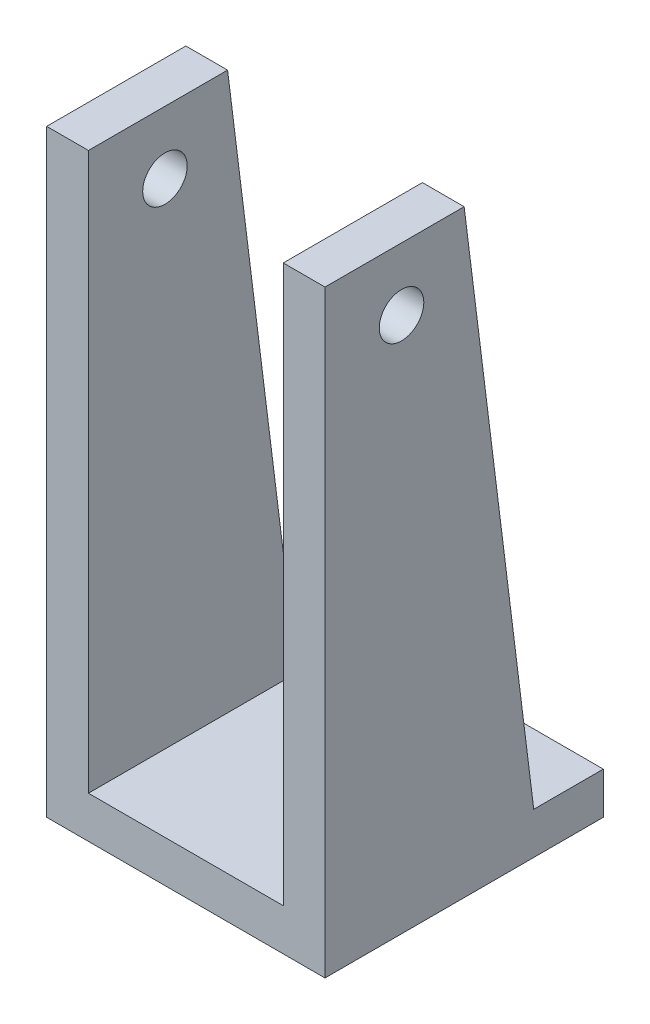
ISO-10303-21;
HEADER;
FILE_DESCRIPTION(('STEP AP214'),'2;1');
FILE_NAME('part.step','',(''),(''),'','','');
FILE_SCHEMA(('AUTOMOTIVE_DESIGN { 1 0 10303 214 1 1 1 1 }'));
ENDSEC;
DATA;
#1=APPLICATION_CONTEXT('core data for automotive mechanical design processes');
#2=APPLICATION_PROTOCOL_DEFINITION('international standard','automotive_design',2000,#1);
#3=PRODUCT_CONTEXT('',#1,'mechanical');
#4=PRODUCT('Part','Part','',(#3));
#5=PRODUCT_RELATED_PRODUCT_CATEGORY('part','',(#4));
#6=PRODUCT_DEFINITION_FORMATION('','',#4);
#7=PRODUCT_DEFINITION_CONTEXT('part definition',#1,'design');
#8=PRODUCT_DEFINITION('design','',#6,#7);
#9=PRODUCT_DEFINITION_SHAPE('','',#8);
#10=(LENGTH_UNIT() NAMED_UNIT(*) SI_UNIT(.MILLI.,.METRE.));
#11=(NAMED_UNIT(*) PLANE_ANGLE_UNIT() SI_UNIT($,.RADIAN.));
#12=(NAMED_UNIT(*) SI_UNIT($,.STERADIAN.) SOLID_ANGLE_UNIT());
#13=UNCERTAINTY_MEASURE_WITH_UNIT(LENGTH_MEASURE(1.E-05),#10,'distance_accuracy_value','');
#14=(GEOMETRIC_REPRESENTATION_CONTEXT(3) GLOBAL_UNCERTAINTY_ASSIGNED_CONTEXT((#13)) GLOBAL_UNIT_ASSIGNED_CONTEXT((#10,
#11,#12)) REPRESENTATION_CONTEXT('',''));
#15=CARTESIAN_POINT('',(0.,0.,0.));
#16=DIRECTION('',(0.,0.,1.));
#17=DIRECTION('',(1.,0.,0.));
#18=AXIS2_PLACEMENT_3D('',#15,#16,#17);
#19=CARTESIAN_POINT('',(-10.,3.,10.));
#20=DIRECTION('',(1.,0.,0.));
#21=DIRECTION('',(0.,0.,-1.));
#22=AXIS2_PLACEMENT_3D('',#19,#20,#21);
#23=PLANE('',#22);
#24=CARTESIAN_POINT('',(-10.,38.5,4.5));
#25=DIRECTION('',(1.,0.,0.));
#26=DIRECTION('',(0.,0.,-1.));
#27=AXIS2_PLACEMENT_3D('',#24,#25,#26);
#28=CIRCLE('',#27,1.6);
#29=CARTESIAN_POINT('',(-10.,38.5,2.9));
#30=VERTEX_POINT('',#29);
#31=EDGE_CURVE('E227',#30,#30,#28,.T.);
#32=ORIENTED_EDGE('',*,*,#31,.T.);
#33=EDGE_LOOP('',(#32));
#34=FACE_BOUND('',#33,.T.);
#35=DIRECTION('',(0.,0.,1.));
#36=VECTOR('',#35,1.);
#37=CARTESIAN_POINT('',(-10.,0.,10.));
#38=LINE('',#37,#36);
#39=CARTESIAN_POINT('',(-10.,0.,-10.));
#40=VERTEX_POINT('',#39);
#41=CARTESIAN_POINT('',(-10.,0.,10.));
#42=VERTEX_POINT('',#41);
#43=EDGE_CURVE('E166',#40,#42,#38,.T.);
#44=ORIENTED_EDGE('',*,*,#43,.T.);
#45=DIRECTION('',(0.,-1.,0.));
#46=VECTOR('',#45,1.);
#47=CARTESIAN_POINT('',(-10.,3.,10.));
#48=LINE('',#47,#46);
#49=CARTESIAN_POINT('',(-10.,43.,10.));
#50=VERTEX_POINT('',#49);
#51=EDGE_CURVE('E11',#50,#42,#48,.T.);
#52=ORIENTED_EDGE('',*,*,#51,.F.);
#53=DIRECTION('',(0.,0.,-1.));
#54=VECTOR('',#53,1.);
#55=CARTESIAN_POINT('',(-10.,43.,10.));
#56=LINE('',#55,#54);
#57=CARTESIAN_POINT('',(-10.,43.,0.));
#58=VERTEX_POINT('',#57);
#59=EDGE_CURVE('E145',#50,#58,#56,.T.);
#60=ORIENTED_EDGE('',*,*,#59,.T.);
#61=DIRECTION('',(0.,-0.992277876713668,-0.124034734589208));
#62=VECTOR('',#61,1.);
#63=CARTESIAN_POINT('',(-10.,43.,0.));
#64=LINE('',#63,#62);
#65=CARTESIAN_POINT('',(-10.,3.,-5.));
#66=VERTEX_POINT('',#65);
#67=EDGE_CURVE('E150',#58,#66,#64,.T.);
#68=ORIENTED_EDGE('',*,*,#67,.T.);
#69=DIRECTION('',(0.,0.,1.));
#70=VECTOR('',#69,1.);
#71=CARTESIAN_POINT('',(-10.,3.,10.));
#72=LINE('',#71,#70);
#73=CARTESIAN_POINT('',(-10.,3.,-10.));
#74=VERTEX_POINT('',#73);
#75=EDGE_CURVE('E171',#74,#66,#72,.T.);
#76=ORIENTED_EDGE('',*,*,#75,.F.);
#77=DIRECTION('',(0.,-1.,0.));
#78=VECTOR('',#77,1.);
#79=CARTESIAN_POINT('',(-10.,3.,-10.));
#80=LINE('',#79,#78);
#81=EDGE_CURVE('E180',#74,#40,#80,.T.);
#82=ORIENTED_EDGE('',*,*,#81,.T.);
#83=EDGE_LOOP('',(#44,#52,#60,#68,#76,#82));
#84=FACE_BOUND('',#83,.T.);
#85=ADVANCED_FACE('F37',(#34,#84),#23,.F.);
#86=CARTESIAN_POINT('',(10.,3.,10.));
#87=DIRECTION('',(0.,0.,-1.));
#88=DIRECTION('',(-1.,0.,0.));
#89=AXIS2_PLACEMENT_3D('',#86,#87,#88);
#90=PLANE('',#89);
#91=DIRECTION('',(1.,0.,0.));
#92=VECTOR('',#91,1.);
#93=CARTESIAN_POINT('',(10.,0.,10.));
#94=LINE('',#93,#92);
#95=CARTESIAN_POINT('',(10.,0.,10.));
#96=VERTEX_POINT('',#95);
#97=EDGE_CURVE('E183',#42,#96,#94,.T.);
#98=ORIENTED_EDGE('',*,*,#97,.T.);
#99=DIRECTION('',(0.,-1.,0.));
#100=VECTOR('',#99,1.);
#101=CARTESIAN_POINT('',(10.,3.,10.));
#102=LINE('',#101,#100);
#103=CARTESIAN_POINT('',(10.,43.,10.));
#104=VERTEX_POINT('',#103);
#105=EDGE_CURVE('E45',#104,#96,#102,.T.);
#106=ORIENTED_EDGE('',*,*,#105,.F.);
#107=DIRECTION('',(1.,0.,0.));
#108=VECTOR('',#107,1.);
#109=CARTESIAN_POINT('',(7.,43.,10.));
#110=LINE('',#109,#108);
#111=CARTESIAN_POINT('',(7.,43.,10.));
#112=VERTEX_POINT('',#111);
#113=EDGE_CURVE('E125',#112,#104,#110,.T.);
#114=ORIENTED_EDGE('',*,*,#113,.F.);
#115=DIRECTION('',(0.,-1.,0.));
#116=VECTOR('',#115,1.);
#117=CARTESIAN_POINT('',(7.,43.,10.));
#118=LINE('',#117,#116);
#119=CARTESIAN_POINT('',(7.,3.,10.));
#120=VERTEX_POINT('',#119);
#121=EDGE_CURVE('E136',#112,#120,#118,.T.);
#122=ORIENTED_EDGE('',*,*,#121,.T.);
#123=DIRECTION('',(1.,0.,0.));
#124=VECTOR('',#123,1.);
#125=CARTESIAN_POINT('',(10.,3.,10.));
#126=LINE('',#125,#124);
#127=CARTESIAN_POINT('',(-7.,3.,10.));
#128=VERTEX_POINT('',#127);
#129=EDGE_CURVE('E57',#128,#120,#126,.T.);
#130=ORIENTED_EDGE('',*,*,#129,.F.);
#131=DIRECTION('',(0.,1.,0.));
#132=VECTOR('',#131,1.);
#133=CARTESIAN_POINT('',(-7.,3.,10.));
#134=LINE('',#133,#132);
#135=CARTESIAN_POINT('',(-7.,43.,10.));
#136=VERTEX_POINT('',#135);
#137=EDGE_CURVE('E149',#128,#136,#134,.T.);
#138=ORIENTED_EDGE('',*,*,#137,.T.);
#139=DIRECTION('',(-1.,0.,0.));
#140=VECTOR('',#139,1.);
#141=CARTESIAN_POINT('',(-7.,43.,10.));
#142=LINE('',#141,#140);
#143=EDGE_CURVE('E159',#136,#50,#142,.T.);
#144=ORIENTED_EDGE('',*,*,#143,.T.);
#145=ORIENTED_EDGE('',*,*,#51,.T.);
#146=EDGE_LOOP('',(#98,#106,#114,#122,#130,#138,#144,#145));
#147=FACE_BOUND('',#146,.T.);
#148=ADVANCED_FACE('F218',(#147),#90,.F.);
#149=CARTESIAN_POINT('',(10.,3.,10.));
#150=DIRECTION('',(-1.,0.,0.));
#151=DIRECTION('',(0.,0.,1.));
#152=AXIS2_PLACEMENT_3D('',#149,#150,#151);
#153=PLANE('',#152);
#154=CARTESIAN_POINT('',(10.,38.5,4.5));
#155=DIRECTION('',(1.,0.,0.));
#156=DIRECTION('',(0.,0.,-1.));
#157=AXIS2_PLACEMENT_3D('',#154,#155,#156);
#158=CIRCLE('',#157,1.6);
#159=CARTESIAN_POINT('',(10.,38.5,2.9));
#160=VERTEX_POINT('',#159);
#161=EDGE_CURVE('E224',#160,#160,#158,.T.);
#162=ORIENTED_EDGE('',*,*,#161,.F.);
#163=EDGE_LOOP('',(#162));
#164=FACE_BOUND('',#163,.T.);
#165=DIRECTION('',(0.,0.,-1.));
#166=VECTOR('',#165,1.);
#167=CARTESIAN_POINT('',(10.,0.,10.));
#168=LINE('',#167,#166);
#169=CARTESIAN_POINT('',(10.,0.,-10.));
#170=VERTEX_POINT('',#169);
#171=EDGE_CURVE('E185',#96,#170,#168,.T.);
#172=ORIENTED_EDGE('',*,*,#171,.T.);
#173=DIRECTION('',(0.,-1.,0.));
#174=VECTOR('',#173,1.);
#175=CARTESIAN_POINT('',(10.,3.,-10.));
#176=LINE('',#175,#174);
#177=CARTESIAN_POINT('',(10.,3.,-10.));
#178=VERTEX_POINT('',#177);
#179=EDGE_CURVE('E190',#178,#170,#176,.T.);
#180=ORIENTED_EDGE('',*,*,#179,.F.);
#181=DIRECTION('',(0.,0.,-1.));
#182=VECTOR('',#181,1.);
#183=CARTESIAN_POINT('',(10.,3.,10.));
#184=LINE('',#183,#182);
#185=CARTESIAN_POINT('',(10.,3.,-5.));
#186=VERTEX_POINT('',#185);
#187=EDGE_CURVE('E176',#186,#178,#184,.T.);
#188=ORIENTED_EDGE('',*,*,#187,.F.);
#189=DIRECTION('',(0.,0.992277876713668,0.124034734589208));
#190=VECTOR('',#189,1.);
#191=CARTESIAN_POINT('',(10.,3.,-5.));
#192=LINE('',#191,#190);
#193=CARTESIAN_POINT('',(10.,43.,0.));
#194=VERTEX_POINT('',#193);
#195=EDGE_CURVE('E141',#186,#194,#192,.T.);
#196=ORIENTED_EDGE('',*,*,#195,.T.);
#197=DIRECTION('',(0.,0.,1.));
#198=VECTOR('',#197,1.);
#199=CARTESIAN_POINT('',(10.,43.,0.));
#200=LINE('',#199,#198);
#201=EDGE_CURVE('E121',#194,#104,#200,.T.);
#202=ORIENTED_EDGE('',*,*,#201,.T.);
#203=ORIENTED_EDGE('',*,*,#105,.T.);
#204=EDGE_LOOP('',(#172,#180,#188,#196,#202,#203));
#205=FACE_BOUND('',#204,.T.);
#206=ADVANCED_FACE('F196',(#164,#205),#153,.F.);
#207=CARTESIAN_POINT('',(10.,3.,-10.));
#208=DIRECTION('',(0.,0.,1.));
#209=DIRECTION('',(1.,0.,0.));
#210=AXIS2_PLACEMENT_3D('',#207,#208,#209);
#211=PLANE('',#210);
#212=DIRECTION('',(-1.,0.,0.));
#213=VECTOR('',#212,1.);
#214=CARTESIAN_POINT('',(10.,0.,-10.));
#215=LINE('',#214,#213);
#216=EDGE_CURVE('E174',#170,#40,#215,.T.);
#217=ORIENTED_EDGE('',*,*,#216,.T.);
#218=ORIENTED_EDGE('',*,*,#81,.F.);
#219=DIRECTION('',(-1.,0.,0.));
#220=VECTOR('',#219,1.);
#221=CARTESIAN_POINT('',(10.,3.,-10.));
#222=LINE('',#221,#220);
#223=EDGE_CURVE('E178',#178,#74,#222,.T.);
#224=ORIENTED_EDGE('',*,*,#223,.F.);
#225=ORIENTED_EDGE('',*,*,#179,.T.);
#226=EDGE_LOOP('',(#217,#218,#224,#225));
#227=FACE_BOUND('',#226,.T.);
#228=ADVANCED_FACE('F205',(#227),#211,.F.);
#229=CARTESIAN_POINT('',(0.,3.,0.));
#230=DIRECTION('',(0.,1.,0.));
#231=DIRECTION('',(0.,0.,1.));
#232=AXIS2_PLACEMENT_3D('',#229,#230,#231);
#233=PLANE('',#232);
#234=CARTESIAN_POINT('',(0.,3.,0.));
#235=DIRECTION('',(0.,1.,0.));
#236=DIRECTION('',(0.,0.,1.));
#237=AXIS2_PLACEMENT_3D('',#234,#235,#236);
#238=CIRCLE('',#237,2.);
#239=CARTESIAN_POINT('',(0.,3.,2.));
#240=VERTEX_POINT('',#239);
#241=EDGE_CURVE('E231',#240,#240,#238,.T.);
#242=ORIENTED_EDGE('',*,*,#241,.F.);
#243=EDGE_LOOP('',(#242));
#244=FACE_BOUND('',#243,.T.);
#245=DIRECTION('',(1.,0.,0.));
#246=VECTOR('',#245,1.);
#247=CARTESIAN_POINT('',(7.,3.,-5.));
#248=LINE('',#247,#246);
#249=CARTESIAN_POINT('',(7.,3.,-5.));
#250=VERTEX_POINT('',#249);
#251=EDGE_CURVE('E126',#250,#186,#248,.T.);
#252=ORIENTED_EDGE('',*,*,#251,.T.);
#253=ORIENTED_EDGE('',*,*,#187,.T.);
#254=ORIENTED_EDGE('',*,*,#223,.T.);
#255=ORIENTED_EDGE('',*,*,#75,.T.);
#256=DIRECTION('',(-1.,0.,0.));
#257=VECTOR('',#256,1.);
#258=CARTESIAN_POINT('',(-7.,3.,-5.));
#259=LINE('',#258,#257);
#260=CARTESIAN_POINT('',(-7.,3.,-5.));
#261=VERTEX_POINT('',#260);
#262=EDGE_CURVE('E164',#261,#66,#259,.T.);
#263=ORIENTED_EDGE('',*,*,#262,.F.);
#264=DIRECTION('',(0.,0.,1.));
#265=VECTOR('',#264,1.);
#266=CARTESIAN_POINT('',(-7.,3.,-5.));
#267=LINE('',#266,#265);
#268=EDGE_CURVE('E147',#261,#128,#267,.T.);
#269=ORIENTED_EDGE('',*,*,#268,.T.);
#270=ORIENTED_EDGE('',*,*,#129,.T.);
#271=DIRECTION('',(0.,0.,-1.));
#272=VECTOR('',#271,1.);
#273=CARTESIAN_POINT('',(7.,3.,10.));
#274=LINE('',#273,#272);
#275=EDGE_CURVE('E52',#120,#250,#274,.T.);
#276=ORIENTED_EDGE('',*,*,#275,.T.);
#277=EDGE_LOOP('',(#252,#253,#254,#255,#263,#269,#270,#276));
#278=FACE_BOUND('',#277,.T.);
#279=ADVANCED_FACE('F211',(#244,#278),#233,.T.);
#280=CARTESIAN_POINT('',(0.,0.,0.));
#281=DIRECTION('',(0.,1.,0.));
#282=DIRECTION('',(0.,0.,1.));
#283=AXIS2_PLACEMENT_3D('',#280,#281,#282);
#284=PLANE('',#283);
#285=CARTESIAN_POINT('',(0.,0.,0.));
#286=DIRECTION('',(0.,1.,0.));
#287=DIRECTION('',(0.,0.,1.));
#288=AXIS2_PLACEMENT_3D('',#285,#286,#287);
#289=CIRCLE('',#288,2.);
#290=CARTESIAN_POINT('',(0.,0.,2.));
#291=VERTEX_POINT('',#290);
#292=EDGE_CURVE('E228',#291,#291,#289,.T.);
#293=ORIENTED_EDGE('',*,*,#292,.T.);
#294=EDGE_LOOP('',(#293));
#295=FACE_BOUND('',#294,.T.);
#296=ORIENTED_EDGE('',*,*,#43,.F.);
#297=ORIENTED_EDGE('',*,*,#216,.F.);
#298=ORIENTED_EDGE('',*,*,#171,.F.);
#299=ORIENTED_EDGE('',*,*,#97,.F.);
#300=EDGE_LOOP('',(#296,#297,#298,#299));
#301=FACE_BOUND('',#300,.T.);
#302=ADVANCED_FACE('F202',(#295,#301),#284,.F.);
#303=CARTESIAN_POINT('',(-7.,43.,0.));
#304=DIRECTION('',(0.,0.124034734589208,-0.992277876713668));
#305=DIRECTION('',(0.,0.992277876713668,0.124034734589208));
#306=AXIS2_PLACEMENT_3D('',#303,#304,#305);
#307=PLANE('',#306);
#308=ORIENTED_EDGE('',*,*,#67,.F.);
#309=DIRECTION('',(-1.,0.,0.));
#310=VECTOR('',#309,1.);
#311=CARTESIAN_POINT('',(-7.,43.,0.));
#312=LINE('',#311,#310);
#313=CARTESIAN_POINT('',(-7.,43.,0.));
#314=VERTEX_POINT('',#313);
#315=EDGE_CURVE('E167',#314,#58,#312,.T.);
#316=ORIENTED_EDGE('',*,*,#315,.F.);
#317=DIRECTION('',(0.,-0.992277876713668,-0.124034734589208));
#318=VECTOR('',#317,1.);
#319=CARTESIAN_POINT('',(-7.,43.,0.));
#320=LINE('',#319,#318);
#321=EDGE_CURVE('E156',#314,#261,#320,.T.);
#322=ORIENTED_EDGE('',*,*,#321,.T.);
#323=ORIENTED_EDGE('',*,*,#262,.T.);
#324=EDGE_LOOP('',(#308,#316,#322,#323));
#325=FACE_BOUND('',#324,.T.);
#326=ADVANCED_FACE('F213',(#325),#307,.T.);
#327=CARTESIAN_POINT('',(-7.,43.,10.));
#328=DIRECTION('',(0.,1.,0.));
#329=DIRECTION('',(0.,0.,1.));
#330=AXIS2_PLACEMENT_3D('',#327,#328,#329);
#331=PLANE('',#330);
#332=ORIENTED_EDGE('',*,*,#59,.F.);
#333=ORIENTED_EDGE('',*,*,#143,.F.);
#334=DIRECTION('',(0.,0.,-1.));
#335=VECTOR('',#334,1.);
#336=CARTESIAN_POINT('',(-7.,43.,10.));
#337=LINE('',#336,#335);
#338=EDGE_CURVE('E153',#136,#314,#337,.T.);
#339=ORIENTED_EDGE('',*,*,#338,.T.);
#340=ORIENTED_EDGE('',*,*,#315,.T.);
#341=EDGE_LOOP('',(#332,#333,#339,#340));
#342=FACE_BOUND('',#341,.T.);
#343=ADVANCED_FACE('F268',(#342),#331,.T.);
#344=CARTESIAN_POINT('',(-7.,0.,0.));
#345=DIRECTION('',(-1.,0.,0.));
#346=DIRECTION('',(0.,0.,1.));
#347=AXIS2_PLACEMENT_3D('',#344,#345,#346);
#348=PLANE('',#347);
#349=CARTESIAN_POINT('',(-7.,38.5,4.5));
#350=DIRECTION('',(-1.,0.,0.));
#351=DIRECTION('',(0.,0.,1.));
#352=AXIS2_PLACEMENT_3D('',#349,#350,#351);
#353=CIRCLE('',#352,1.6);
#354=CARTESIAN_POINT('',(-7.,38.5,6.1));
#355=VERTEX_POINT('',#354);
#356=EDGE_CURVE('E143',#355,#355,#353,.T.);
#357=ORIENTED_EDGE('',*,*,#356,.T.);
#358=EDGE_LOOP('',(#357));
#359=FACE_BOUND('',#358,.T.);
#360=ORIENTED_EDGE('',*,*,#268,.F.);
#361=ORIENTED_EDGE('',*,*,#321,.F.);
#362=ORIENTED_EDGE('',*,*,#338,.F.);
#363=ORIENTED_EDGE('',*,*,#137,.F.);
#364=EDGE_LOOP('',(#360,#361,#362,#363));
#365=FACE_BOUND('',#364,.T.);
#366=ADVANCED_FACE('F217',(#359,#365),#348,.F.);
#367=CARTESIAN_POINT('',(7.,43.,0.));
#368=DIRECTION('',(0.,1.,0.));
#369=DIRECTION('',(0.,0.,1.));
#370=AXIS2_PLACEMENT_3D('',#367,#368,#369);
#371=PLANE('',#370);
#372=ORIENTED_EDGE('',*,*,#201,.F.);
#373=DIRECTION('',(1.,0.,0.));
#374=VECTOR('',#373,1.);
#375=CARTESIAN_POINT('',(7.,43.,0.));
#376=LINE('',#375,#374);
#377=CARTESIAN_POINT('',(7.,43.,0.));
#378=VERTEX_POINT('',#377);
#379=EDGE_CURVE('E114',#378,#194,#376,.T.);
#380=ORIENTED_EDGE('',*,*,#379,.F.);
#381=DIRECTION('',(0.,0.,1.));
#382=VECTOR('',#381,1.);
#383=CARTESIAN_POINT('',(7.,43.,0.));
#384=LINE('',#383,#382);
#385=EDGE_CURVE('E119',#378,#112,#384,.T.);
#386=ORIENTED_EDGE('',*,*,#385,.T.);
#387=ORIENTED_EDGE('',*,*,#113,.T.);
#388=EDGE_LOOP('',(#372,#380,#386,#387));
#389=FACE_BOUND('',#388,.T.);
#390=ADVANCED_FACE('F116',(#389),#371,.T.);
#391=CARTESIAN_POINT('',(7.,3.,-5.));
#392=DIRECTION('',(0.,0.124034734589208,-0.992277876713668));
#393=DIRECTION('',(0.,0.992277876713668,0.124034734589208));
#394=AXIS2_PLACEMENT_3D('',#391,#392,#393);
#395=PLANE('',#394);
#396=ORIENTED_EDGE('',*,*,#195,.F.);
#397=ORIENTED_EDGE('',*,*,#251,.F.);
#398=DIRECTION('',(0.,0.992277876713668,0.124034734589208));
#399=VECTOR('',#398,1.);
#400=CARTESIAN_POINT('',(7.,3.,-5.));
#401=LINE('',#400,#399);
#402=EDGE_CURVE('E129',#250,#378,#401,.T.);
#403=ORIENTED_EDGE('',*,*,#402,.T.);
#404=ORIENTED_EDGE('',*,*,#379,.T.);
#405=EDGE_LOOP('',(#396,#397,#403,#404));
#406=FACE_BOUND('',#405,.T.);
#407=ADVANCED_FACE('F130',(#406),#395,.T.);
#408=CARTESIAN_POINT('',(7.,0.,0.));
#409=DIRECTION('',(1.,0.,0.));
#410=DIRECTION('',(0.,0.,-1.));
#411=AXIS2_PLACEMENT_3D('',#408,#409,#410);
#412=PLANE('',#411);
#413=CARTESIAN_POINT('',(7.,38.5,4.5));
#414=DIRECTION('',(1.,0.,0.));
#415=DIRECTION('',(0.,0.,-1.));
#416=AXIS2_PLACEMENT_3D('',#413,#414,#415);
#417=CIRCLE('',#416,1.6);
#418=CARTESIAN_POINT('',(7.,38.5,2.9));
#419=VERTEX_POINT('',#418);
#420=EDGE_CURVE('E40',#419,#419,#417,.T.);
#421=ORIENTED_EDGE('',*,*,#420,.T.);
#422=EDGE_LOOP('',(#421));
#423=FACE_BOUND('',#422,.T.);
#424=ORIENTED_EDGE('',*,*,#121,.F.);
#425=ORIENTED_EDGE('',*,*,#385,.F.);
#426=ORIENTED_EDGE('',*,*,#402,.F.);
#427=ORIENTED_EDGE('',*,*,#275,.F.);
#428=EDGE_LOOP('',(#424,#425,#426,#427));
#429=FACE_BOUND('',#428,.T.);
#430=ADVANCED_FACE('F134',(#423,#429),#412,.F.);
#431=CARTESIAN_POINT('',(-10.,38.5,4.5));
#432=DIRECTION('',(1.,0.,0.));
#433=DIRECTION('',(0.,0.,-1.));
#434=AXIS2_PLACEMENT_3D('',#431,#432,#433);
#435=CYLINDRICAL_SURFACE('',#434,1.6);
#436=ORIENTED_EDGE('',*,*,#161,.T.);
#437=EDGE_LOOP('',(#436));
#438=FACE_BOUND('',#437,.T.);
#439=ORIENTED_EDGE('',*,*,#420,.F.);
#440=EDGE_LOOP('',(#439));
#441=FACE_BOUND('',#440,.T.);
#442=ADVANCED_FACE('F263',(#438,#441),#435,.F.);
#443=ORIENTED_EDGE('',*,*,#31,.F.);
#444=EDGE_LOOP('',(#443));
#445=FACE_BOUND('',#444,.T.);
#446=ORIENTED_EDGE('',*,*,#356,.F.);
#447=EDGE_LOOP('',(#446));
#448=FACE_BOUND('',#447,.T.);
#449=ADVANCED_FACE('F241',(#445,#448),#435,.F.);
#450=CARTESIAN_POINT('',(0.,0.,0.));
#451=DIRECTION('',(0.,1.,0.));
#452=DIRECTION('',(0.,0.,1.));
#453=AXIS2_PLACEMENT_3D('',#450,#451,#452);
#454=CYLINDRICAL_SURFACE('',#453,2.);
#455=ORIENTED_EDGE('',*,*,#292,.F.);
#456=EDGE_LOOP('',(#455));
#457=FACE_BOUND('',#456,.T.);
#458=ORIENTED_EDGE('',*,*,#241,.T.);
#459=EDGE_LOOP('',(#458));
#460=FACE_BOUND('',#459,.T.);
#461=ADVANCED_FACE('F238',(#457,#460),#454,.F.);
#462=CLOSED_SHELL('',(#85,#148,#206,#228,#279,#302,#326,#343,#366,#390,#407,#430,#442,#449,#461));
#463=MANIFOLD_SOLID_BREP('B2',#462);
#464=ADVANCED_BREP_SHAPE_REPRESENTATION('',(#18,#463),#14);
#465=SHAPE_DEFINITION_REPRESENTATION(#9,#464);
ENDSEC;
END-ISO-10303-21;
